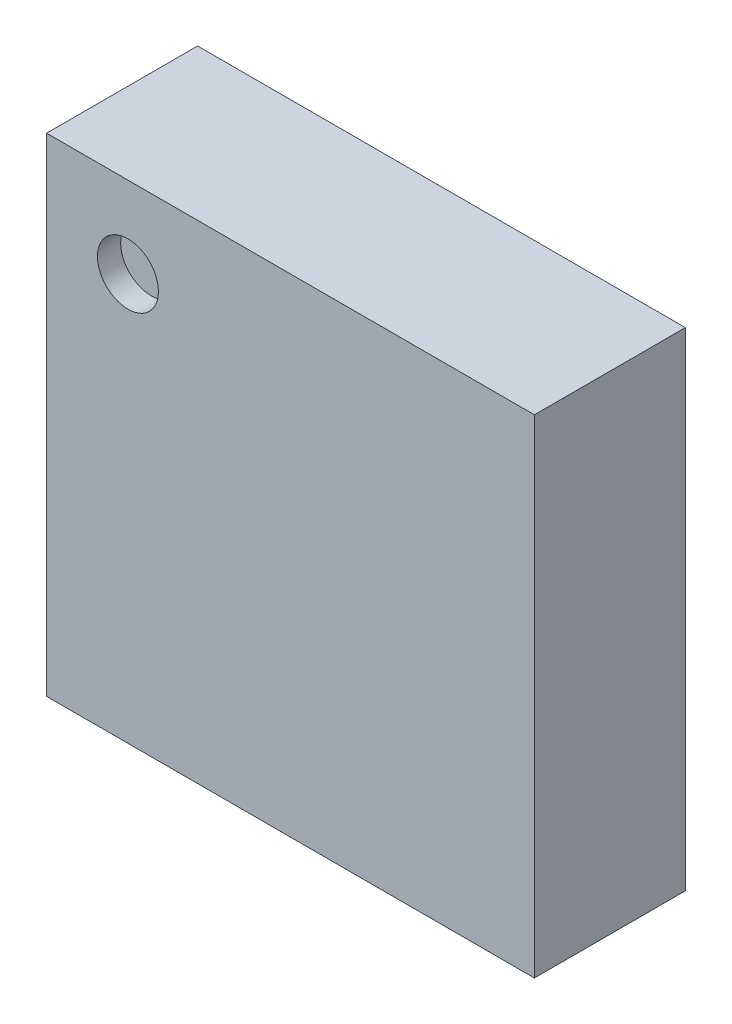
ISO-10303-21;
HEADER;
FILE_DESCRIPTION(('STEP AP214'),'2;1');
FILE_NAME('part.step','',(''),(''),'','','');
FILE_SCHEMA(('AUTOMOTIVE_DESIGN { 1 0 10303 214 1 1 1 1 }'));
ENDSEC;
DATA;
#1=APPLICATION_CONTEXT('core data for automotive mechanical design processes');
#2=APPLICATION_PROTOCOL_DEFINITION('international standard','automotive_design',2000,#1);
#3=PRODUCT_CONTEXT('',#1,'mechanical');
#4=PRODUCT('Part','Part','',(#3));
#5=PRODUCT_RELATED_PRODUCT_CATEGORY('part','',(#4));
#6=PRODUCT_DEFINITION_FORMATION('','',#4);
#7=PRODUCT_DEFINITION_CONTEXT('part definition',#1,'design');
#8=PRODUCT_DEFINITION('design','',#6,#7);
#9=PRODUCT_DEFINITION_SHAPE('','',#8);
#10=(LENGTH_UNIT() NAMED_UNIT(*) SI_UNIT(.MILLI.,.METRE.));
#11=(NAMED_UNIT(*) PLANE_ANGLE_UNIT() SI_UNIT($,.RADIAN.));
#12=(NAMED_UNIT(*) SI_UNIT($,.STERADIAN.) SOLID_ANGLE_UNIT());
#13=UNCERTAINTY_MEASURE_WITH_UNIT(LENGTH_MEASURE(1.E-05),#10,'distance_accuracy_value','');
#14=(GEOMETRIC_REPRESENTATION_CONTEXT(3) GLOBAL_UNCERTAINTY_ASSIGNED_CONTEXT((#13)) GLOBAL_UNIT_ASSIGNED_CONTEXT((#10,
#11,#12)) REPRESENTATION_CONTEXT('',''));
#15=CARTESIAN_POINT('',(0.,0.,0.));
#16=DIRECTION('',(0.,0.,1.));
#17=DIRECTION('',(1.,0.,0.));
#18=AXIS2_PLACEMENT_3D('',#15,#16,#17);
#19=CARTESIAN_POINT('',(0.35,1.75,0.55));
#20=DIRECTION('',(0.,0.,1.));
#21=DIRECTION('',(1.,0.,0.));
#22=AXIS2_PLACEMENT_3D('',#19,#20,#21);
#23=PLANE('',#22);
#24=CARTESIAN_POINT('',(0.35,1.75,0.55));
#25=DIRECTION('',(0.,0.,1.));
#26=DIRECTION('',(1.,0.,0.));
#27=AXIS2_PLACEMENT_3D('',#24,#25,#26);
#28=CIRCLE('',#27,0.13125);
#29=CARTESIAN_POINT('',(0.21875,1.75,0.55));
#30=VERTEX_POINT('',#29);
#31=EDGE_CURVE('E27',#30,#30,#28,.T.);
#32=ORIENTED_EDGE('',*,*,#31,.T.);
#33=EDGE_LOOP('',(#32));
#34=FACE_BOUND('',#33,.T.);
#35=ADVANCED_FACE('F16',(#34),#23,.T.);
#36=CARTESIAN_POINT('',(0.35,1.75,0.55));
#37=DIRECTION('',(0.,0.,1.));
#38=DIRECTION('',(1.,0.,0.));
#39=AXIS2_PLACEMENT_3D('',#36,#37,#38);
#40=CYLINDRICAL_SURFACE('',#39,0.13125);
#41=ORIENTED_EDGE('',*,*,#31,.F.);
#42=DIRECTION('',(0.,0.,1.));
#43=VECTOR('',#42,1.);
#44=CARTESIAN_POINT('',(0.21875,1.75,0.55));
#45=LINE('',#44,#43);
#46=CARTESIAN_POINT('',(0.21875,1.75,0.65));
#47=VERTEX_POINT('',#46);
#48=EDGE_CURVE('E11',#30,#47,#45,.T.);
#49=ORIENTED_EDGE('',*,*,#48,.T.);
#50=CARTESIAN_POINT('',(0.35,1.75,0.65));
#51=DIRECTION('',(0.,0.,1.));
#52=DIRECTION('',(1.,0.,0.));
#53=AXIS2_PLACEMENT_3D('',#50,#51,#52);
#54=CIRCLE('',#53,0.13125);
#55=EDGE_CURVE('E104',#47,#47,#54,.T.);
#56=ORIENTED_EDGE('',*,*,#55,.T.);
#57=ORIENTED_EDGE('',*,*,#48,.F.);
#58=EDGE_LOOP('',(#41,#49,#56,#57));
#59=FACE_BOUND('',#58,.T.);
#60=ADVANCED_FACE('F158',(#59),#40,.F.);
#61=CARTESIAN_POINT('',(2.1,0.,0.));
#62=DIRECTION('',(1.,0.,0.));
#63=DIRECTION('',(0.,1.,0.));
#64=AXIS2_PLACEMENT_3D('',#61,#62,#63);
#65=PLANE('',#64);
#66=DIRECTION('',(0.,0.,1.));
#67=VECTOR('',#66,1.);
#68=CARTESIAN_POINT('',(2.1,0.,0.));
#69=LINE('',#68,#67);
#70=CARTESIAN_POINT('',(2.1,0.,0.));
#71=VERTEX_POINT('',#70);
#72=CARTESIAN_POINT('',(2.1,0.,0.65));
#73=VERTEX_POINT('',#72);
#74=EDGE_CURVE('E128',#71,#73,#69,.T.);
#75=ORIENTED_EDGE('',*,*,#74,.F.);
#76=DIRECTION('',(0.,1.,0.));
#77=VECTOR('',#76,1.);
#78=CARTESIAN_POINT('',(2.1,0.,0.));
#79=LINE('',#78,#77);
#80=CARTESIAN_POINT('',(2.1,2.1,0.));
#81=VERTEX_POINT('',#80);
#82=EDGE_CURVE('E90',#71,#81,#79,.T.);
#83=ORIENTED_EDGE('',*,*,#82,.T.);
#84=DIRECTION('',(0.,0.,1.));
#85=VECTOR('',#84,1.);
#86=CARTESIAN_POINT('',(2.1,2.1,0.));
#87=LINE('',#86,#85);
#88=CARTESIAN_POINT('',(2.1,2.1,0.65));
#89=VERTEX_POINT('',#88);
#90=EDGE_CURVE('E102',#81,#89,#87,.T.);
#91=ORIENTED_EDGE('',*,*,#90,.T.);
#92=DIRECTION('',(0.,1.,0.));
#93=VECTOR('',#92,1.);
#94=CARTESIAN_POINT('',(2.1,0.,0.65));
#95=LINE('',#94,#93);
#96=EDGE_CURVE('E86',#73,#89,#95,.T.);
#97=ORIENTED_EDGE('',*,*,#96,.F.);
#98=EDGE_LOOP('',(#75,#83,#91,#97));
#99=FACE_BOUND('',#98,.T.);
#100=ADVANCED_FACE('F146',(#99),#65,.T.);
#101=CARTESIAN_POINT('',(0.,0.,0.));
#102=DIRECTION('',(0.,0.,1.));
#103=DIRECTION('',(1.,0.,0.));
#104=AXIS2_PLACEMENT_3D('',#101,#102,#103);
#105=PLANE('',#104);
#106=DIRECTION('',(0.,1.,0.));
#107=VECTOR('',#106,1.);
#108=CARTESIAN_POINT('',(0.,0.,0.));
#109=LINE('',#108,#107);
#110=CARTESIAN_POINT('',(0.,0.,0.));
#111=VERTEX_POINT('',#110);
#112=CARTESIAN_POINT('',(0.,2.1,0.));
#113=VERTEX_POINT('',#112);
#114=EDGE_CURVE('E106',#111,#113,#109,.T.);
#115=ORIENTED_EDGE('',*,*,#114,.T.);
#116=DIRECTION('',(1.,0.,0.));
#117=VECTOR('',#116,1.);
#118=CARTESIAN_POINT('',(0.,2.1,0.));
#119=LINE('',#118,#117);
#120=EDGE_CURVE('E97',#113,#81,#119,.T.);
#121=ORIENTED_EDGE('',*,*,#120,.T.);
#122=ORIENTED_EDGE('',*,*,#82,.F.);
#123=DIRECTION('',(1.,0.,0.));
#124=VECTOR('',#123,1.);
#125=CARTESIAN_POINT('',(0.,0.,0.));
#126=LINE('',#125,#124);
#127=EDGE_CURVE('E60',#111,#71,#126,.T.);
#128=ORIENTED_EDGE('',*,*,#127,.F.);
#129=EDGE_LOOP('',(#115,#121,#122,#128));
#130=FACE_BOUND('',#129,.T.);
#131=ADVANCED_FACE('F107',(#130),#105,.F.);
#132=CARTESIAN_POINT('',(0.,2.1,0.));
#133=DIRECTION('',(0.,1.,0.));
#134=DIRECTION('',(1.,0.,0.));
#135=AXIS2_PLACEMENT_3D('',#132,#133,#134);
#136=PLANE('',#135);
#137=ORIENTED_EDGE('',*,*,#120,.F.);
#138=DIRECTION('',(0.,0.,1.));
#139=VECTOR('',#138,1.);
#140=CARTESIAN_POINT('',(0.,2.1,0.));
#141=LINE('',#140,#139);
#142=CARTESIAN_POINT('',(0.,2.1,0.65));
#143=VERTEX_POINT('',#142);
#144=EDGE_CURVE('E20',#113,#143,#141,.T.);
#145=ORIENTED_EDGE('',*,*,#144,.T.);
#146=DIRECTION('',(1.,0.,0.));
#147=VECTOR('',#146,1.);
#148=CARTESIAN_POINT('',(0.,2.1,0.65));
#149=LINE('',#148,#147);
#150=EDGE_CURVE('E131',#143,#89,#149,.T.);
#151=ORIENTED_EDGE('',*,*,#150,.T.);
#152=ORIENTED_EDGE('',*,*,#90,.F.);
#153=EDGE_LOOP('',(#137,#145,#151,#152));
#154=FACE_BOUND('',#153,.T.);
#155=ADVANCED_FACE('F98',(#154),#136,.T.);
#156=CARTESIAN_POINT('',(0.,0.,0.65));
#157=DIRECTION('',(0.,0.,1.));
#158=DIRECTION('',(1.,0.,0.));
#159=AXIS2_PLACEMENT_3D('',#156,#157,#158);
#160=PLANE('',#159);
#161=ORIENTED_EDGE('',*,*,#55,.F.);
#162=EDGE_LOOP('',(#161));
#163=FACE_BOUND('',#162,.T.);
#164=DIRECTION('',(0.,1.,0.));
#165=VECTOR('',#164,1.);
#166=CARTESIAN_POINT('',(0.,0.,0.65));
#167=LINE('',#166,#165);
#168=CARTESIAN_POINT('',(0.,0.,0.65));
#169=VERTEX_POINT('',#168);
#170=EDGE_CURVE('E113',#169,#143,#167,.T.);
#171=ORIENTED_EDGE('',*,*,#170,.F.);
#172=DIRECTION('',(1.,0.,0.));
#173=VECTOR('',#172,1.);
#174=CARTESIAN_POINT('',(0.,0.,0.65));
#175=LINE('',#174,#173);
#176=EDGE_CURVE('E72',#169,#73,#175,.T.);
#177=ORIENTED_EDGE('',*,*,#176,.T.);
#178=ORIENTED_EDGE('',*,*,#96,.T.);
#179=ORIENTED_EDGE('',*,*,#150,.F.);
#180=EDGE_LOOP('',(#171,#177,#178,#179));
#181=FACE_BOUND('',#180,.T.);
#182=ADVANCED_FACE('F148',(#163,#181),#160,.T.);
#183=CARTESIAN_POINT('',(0.,0.,0.));
#184=DIRECTION('',(0.,1.,0.));
#185=DIRECTION('',(1.,0.,0.));
#186=AXIS2_PLACEMENT_3D('',#183,#184,#185);
#187=PLANE('',#186);
#188=ORIENTED_EDGE('',*,*,#127,.T.);
#189=ORIENTED_EDGE('',*,*,#74,.T.);
#190=ORIENTED_EDGE('',*,*,#176,.F.);
#191=DIRECTION('',(0.,0.,1.));
#192=VECTOR('',#191,1.);
#193=CARTESIAN_POINT('',(0.,0.,0.));
#194=LINE('',#193,#192);
#195=EDGE_CURVE('E119',#111,#169,#194,.T.);
#196=ORIENTED_EDGE('',*,*,#195,.F.);
#197=EDGE_LOOP('',(#188,#189,#190,#196));
#198=FACE_BOUND('',#197,.T.);
#199=ADVANCED_FACE('F18',(#198),#187,.F.);
#200=CARTESIAN_POINT('',(0.,0.,0.));
#201=DIRECTION('',(1.,0.,0.));
#202=DIRECTION('',(0.,1.,0.));
#203=AXIS2_PLACEMENT_3D('',#200,#201,#202);
#204=PLANE('',#203);
#205=ORIENTED_EDGE('',*,*,#195,.T.);
#206=ORIENTED_EDGE('',*,*,#170,.T.);
#207=ORIENTED_EDGE('',*,*,#144,.F.);
#208=ORIENTED_EDGE('',*,*,#114,.F.);
#209=EDGE_LOOP('',(#205,#206,#207,#208));
#210=FACE_BOUND('',#209,.T.);
#211=ADVANCED_FACE('F112',(#210),#204,.F.);
#212=CLOSED_SHELL('',(#35,#60,#100,#131,#155,#182,#199,#211));
#213=MANIFOLD_SOLID_BREP('B1',#212);
#214=ADVANCED_BREP_SHAPE_REPRESENTATION('',(#18,#213),#14);
#215=SHAPE_DEFINITION_REPRESENTATION(#9,#214);
ENDSEC;
END-ISO-10303-21;
